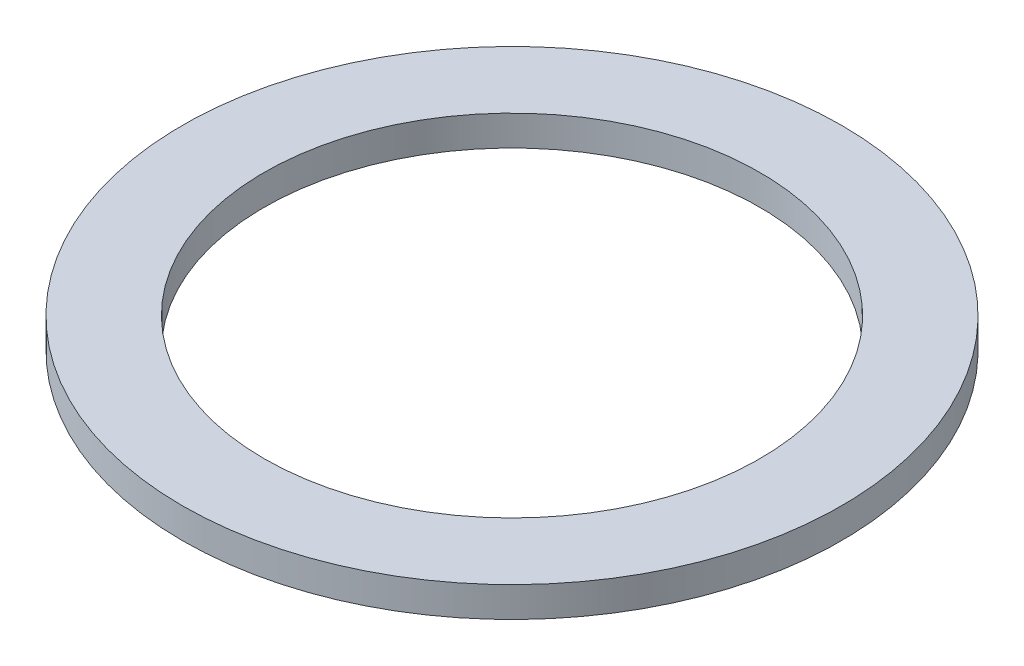
ISO-10303-21;
HEADER;
FILE_DESCRIPTION(('STEP AP214'),'2;1');
FILE_NAME('part.step','',(''),(''),'','','');
FILE_SCHEMA(('AUTOMOTIVE_DESIGN { 1 0 10303 214 1 1 1 1 }'));
ENDSEC;
DATA;
#1=APPLICATION_CONTEXT('core data for automotive mechanical design processes');
#2=APPLICATION_PROTOCOL_DEFINITION('international standard','automotive_design',2000,#1);
#3=PRODUCT_CONTEXT('',#1,'mechanical');
#4=PRODUCT('Part','Part','',(#3));
#5=PRODUCT_RELATED_PRODUCT_CATEGORY('part','',(#4));
#6=PRODUCT_DEFINITION_FORMATION('','',#4);
#7=PRODUCT_DEFINITION_CONTEXT('part definition',#1,'design');
#8=PRODUCT_DEFINITION('design','',#6,#7);
#9=PRODUCT_DEFINITION_SHAPE('','',#8);
#10=(LENGTH_UNIT() NAMED_UNIT(*) SI_UNIT(.MILLI.,.METRE.));
#11=(NAMED_UNIT(*) PLANE_ANGLE_UNIT() SI_UNIT($,.RADIAN.));
#12=(NAMED_UNIT(*) SI_UNIT($,.STERADIAN.) SOLID_ANGLE_UNIT());
#13=UNCERTAINTY_MEASURE_WITH_UNIT(LENGTH_MEASURE(1.E-05),#10,'distance_accuracy_value','');
#14=(GEOMETRIC_REPRESENTATION_CONTEXT(3) GLOBAL_UNCERTAINTY_ASSIGNED_CONTEXT((#13)) GLOBAL_UNIT_ASSIGNED_CONTEXT((#10,
#11,#12)) REPRESENTATION_CONTEXT('',''));
#15=CARTESIAN_POINT('',(0.,0.,0.));
#16=DIRECTION('',(0.,0.,1.));
#17=DIRECTION('',(1.,0.,0.));
#18=AXIS2_PLACEMENT_3D('',#15,#16,#17);
#19=CARTESIAN_POINT('',(0.,0.5,0.));
#20=DIRECTION('',(0.,1.,0.));
#21=DIRECTION('',(0.,0.,1.));
#22=AXIS2_PLACEMENT_3D('',#19,#20,#21);
#23=PLANE('',#22);
#24=CARTESIAN_POINT('',(0.,0.5,0.));
#25=DIRECTION('',(0.,1.,0.));
#26=DIRECTION('',(0.,0.,1.));
#27=AXIS2_PLACEMENT_3D('',#24,#25,#26);
#28=CIRCLE('',#27,5.45);
#29=CARTESIAN_POINT('',(0.,0.5,5.45));
#30=VERTEX_POINT('',#29);
#31=EDGE_CURVE('E12',#30,#30,#28,.T.);
#32=ORIENTED_EDGE('',*,*,#31,.T.);
#33=EDGE_LOOP('',(#32));
#34=FACE_BOUND('',#33,.T.);
#35=CARTESIAN_POINT('',(0.,0.5,0.));
#36=DIRECTION('',(0.,1.,0.));
#37=DIRECTION('',(0.,0.,1.));
#38=AXIS2_PLACEMENT_3D('',#35,#36,#37);
#39=CIRCLE('',#38,4.1);
#40=CARTESIAN_POINT('',(0.,0.5,4.1));
#41=VERTEX_POINT('',#40);
#42=EDGE_CURVE('E54',#41,#41,#39,.T.);
#43=ORIENTED_EDGE('',*,*,#42,.F.);
#44=EDGE_LOOP('',(#43));
#45=FACE_BOUND('',#44,.T.);
#46=ADVANCED_FACE('F43',(#34,#45),#23,.T.);
#47=CARTESIAN_POINT('',(0.,0.,0.));
#48=DIRECTION('',(0.,1.,0.));
#49=DIRECTION('',(0.,0.,1.));
#50=AXIS2_PLACEMENT_3D('',#47,#48,#49);
#51=PLANE('',#50);
#52=CARTESIAN_POINT('',(0.,0.,0.));
#53=DIRECTION('',(0.,1.,0.));
#54=DIRECTION('',(0.,0.,1.));
#55=AXIS2_PLACEMENT_3D('',#52,#53,#54);
#56=CIRCLE('',#55,5.45);
#57=CARTESIAN_POINT('',(0.,0.,5.45));
#58=VERTEX_POINT('',#57);
#59=EDGE_CURVE('E47',#58,#58,#56,.T.);
#60=ORIENTED_EDGE('',*,*,#59,.F.);
#61=EDGE_LOOP('',(#60));
#62=FACE_BOUND('',#61,.T.);
#63=CARTESIAN_POINT('',(0.,0.,0.));
#64=DIRECTION('',(0.,1.,0.));
#65=DIRECTION('',(0.,0.,1.));
#66=AXIS2_PLACEMENT_3D('',#63,#64,#65);
#67=CIRCLE('',#66,4.1);
#68=CARTESIAN_POINT('',(0.,0.,4.1));
#69=VERTEX_POINT('',#68);
#70=EDGE_CURVE('E56',#69,#69,#67,.T.);
#71=ORIENTED_EDGE('',*,*,#70,.T.);
#72=EDGE_LOOP('',(#71));
#73=FACE_BOUND('',#72,.T.);
#74=ADVANCED_FACE('F66',(#62,#73),#51,.F.);
#75=CARTESIAN_POINT('',(0.,0.5,0.));
#76=DIRECTION('',(0.,-1.,0.));
#77=DIRECTION('',(0.,0.,-1.));
#78=AXIS2_PLACEMENT_3D('',#75,#76,#77);
#79=CYLINDRICAL_SURFACE('',#78,5.45);
#80=ORIENTED_EDGE('',*,*,#31,.F.);
#81=EDGE_LOOP('',(#80));
#82=FACE_BOUND('',#81,.T.);
#83=ORIENTED_EDGE('',*,*,#59,.T.);
#84=EDGE_LOOP('',(#83));
#85=FACE_BOUND('',#84,.T.);
#86=ADVANCED_FACE('F45',(#82,#85),#79,.T.);
#87=CARTESIAN_POINT('',(0.,0.5,0.));
#88=DIRECTION('',(0.,-1.,0.));
#89=DIRECTION('',(0.,0.,-1.));
#90=AXIS2_PLACEMENT_3D('',#87,#88,#89);
#91=CYLINDRICAL_SURFACE('',#90,4.1);
#92=ORIENTED_EDGE('',*,*,#42,.T.);
#93=EDGE_LOOP('',(#92));
#94=FACE_BOUND('',#93,.T.);
#95=ORIENTED_EDGE('',*,*,#70,.F.);
#96=EDGE_LOOP('',(#95));
#97=FACE_BOUND('',#96,.T.);
#98=ADVANCED_FACE('F62',(#94,#97),#91,.F.);
#99=CLOSED_SHELL('',(#46,#74,#86,#98));
#100=MANIFOLD_SOLID_BREP('B2',#99);
#101=ADVANCED_BREP_SHAPE_REPRESENTATION('',(#18,#100),#14);
#102=SHAPE_DEFINITION_REPRESENTATION(#9,#101);
ENDSEC;
END-ISO-10303-21;
